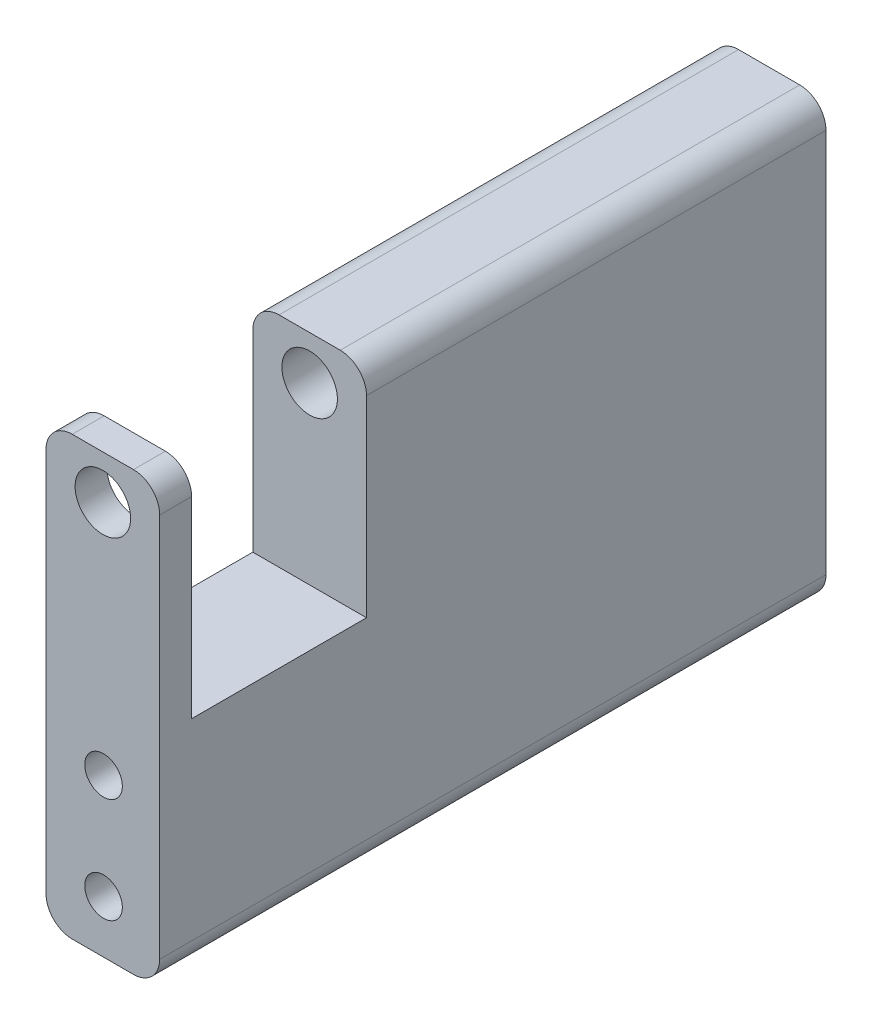
ISO-10303-21;
HEADER;
FILE_DESCRIPTION(('STEP AP214'),'2;1');
FILE_NAME('part.step','',(''),(''),'','','');
FILE_SCHEMA(('AUTOMOTIVE_DESIGN { 1 0 10303 214 1 1 1 1 }'));
ENDSEC;
DATA;
#1=APPLICATION_CONTEXT('core data for automotive mechanical design processes');
#2=APPLICATION_PROTOCOL_DEFINITION('international standard','automotive_design',2000,#1);
#3=PRODUCT_CONTEXT('',#1,'mechanical');
#4=PRODUCT('Part','Part','',(#3));
#5=PRODUCT_RELATED_PRODUCT_CATEGORY('part','',(#4));
#6=PRODUCT_DEFINITION_FORMATION('','',#4);
#7=PRODUCT_DEFINITION_CONTEXT('part definition',#1,'design');
#8=PRODUCT_DEFINITION('design','',#6,#7);
#9=PRODUCT_DEFINITION_SHAPE('','',#8);
#10=(LENGTH_UNIT() NAMED_UNIT(*) SI_UNIT(.MILLI.,.METRE.));
#11=(NAMED_UNIT(*) PLANE_ANGLE_UNIT() SI_UNIT($,.RADIAN.));
#12=(NAMED_UNIT(*) SI_UNIT($,.STERADIAN.) SOLID_ANGLE_UNIT());
#13=UNCERTAINTY_MEASURE_WITH_UNIT(LENGTH_MEASURE(1.E-05),#10,'distance_accuracy_value','');
#14=(GEOMETRIC_REPRESENTATION_CONTEXT(3) GLOBAL_UNCERTAINTY_ASSIGNED_CONTEXT((#13)) GLOBAL_UNIT_ASSIGNED_CONTEXT((#10,
#11,#12)) REPRESENTATION_CONTEXT('',''));
#15=CARTESIAN_POINT('',(0.,0.,0.));
#16=DIRECTION('',(0.,0.,1.));
#17=DIRECTION('',(1.,0.,0.));
#18=AXIS2_PLACEMENT_3D('',#15,#16,#17);
#19=CARTESIAN_POINT('',(0.,50.,76.2));
#20=DIRECTION('',(0.,-1.,0.));
#21=DIRECTION('',(0.,0.,-1.));
#22=AXIS2_PLACEMENT_3D('',#19,#20,#21);
#23=PLANE('',#22);
#24=DIRECTION('',(-1.,0.,0.));
#25=VECTOR('',#24,1.);
#26=CARTESIAN_POINT('',(0.,50.,72.55));
#27=LINE('',#26,#25);
#28=CARTESIAN_POINT('',(10.,50.,72.55));
#29=VERTEX_POINT('',#28);
#30=CARTESIAN_POINT('',(3.,50.,72.55));
#31=VERTEX_POINT('',#30);
#32=EDGE_CURVE('E214',#29,#31,#27,.T.);
#33=ORIENTED_EDGE('',*,*,#32,.T.);
#34=DIRECTION('',(0.,0.,-1.));
#35=VECTOR('',#34,1.);
#36=CARTESIAN_POINT('',(3.,50.,76.2));
#37=LINE('',#36,#35);
#38=CARTESIAN_POINT('',(3.,50.,76.2));
#39=VERTEX_POINT('',#38);
#40=EDGE_CURVE('E338',#31,#39,#37,.F.);
#41=ORIENTED_EDGE('',*,*,#40,.T.);
#42=DIRECTION('',(-1.,0.,0.));
#43=VECTOR('',#42,1.);
#44=CARTESIAN_POINT('',(0.,50.,76.2));
#45=LINE('',#44,#43);
#46=CARTESIAN_POINT('',(10.,50.,76.2));
#47=VERTEX_POINT('',#46);
#48=EDGE_CURVE('E255',#47,#39,#45,.T.);
#49=ORIENTED_EDGE('',*,*,#48,.F.);
#50=DIRECTION('',(0.,0.,-1.));
#51=VECTOR('',#50,1.);
#52=CARTESIAN_POINT('',(10.,50.,76.2));
#53=LINE('',#52,#51);
#54=EDGE_CURVE('E334',#47,#29,#53,.T.);
#55=ORIENTED_EDGE('',*,*,#54,.T.);
#56=EDGE_LOOP('',(#33,#41,#49,#55));
#57=FACE_BOUND('',#56,.T.);
#58=ADVANCED_FACE('F40',(#57),#23,.F.);
#59=CARTESIAN_POINT('',(6.5,45.,76.2));
#60=DIRECTION('',(0.,0.,-1.));
#61=DIRECTION('',(-1.,0.,0.));
#62=AXIS2_PLACEMENT_3D('',#59,#60,#61);
#63=CYLINDRICAL_SURFACE('',#62,3.175);
#64=CARTESIAN_POINT('',(6.5,45.,76.2));
#65=DIRECTION('',(0.,0.,1.));
#66=DIRECTION('',(1.,0.,0.));
#67=AXIS2_PLACEMENT_3D('',#64,#65,#66);
#68=CIRCLE('',#67,3.175);
#69=CARTESIAN_POINT('',(9.675,45.,76.2));
#70=VERTEX_POINT('',#69);
#71=EDGE_CURVE('E232',#70,#70,#68,.T.);
#72=ORIENTED_EDGE('',*,*,#71,.T.);
#73=EDGE_LOOP('',(#72));
#74=FACE_BOUND('',#73,.T.);
#75=CARTESIAN_POINT('',(6.5,45.,72.55));
#76=DIRECTION('',(0.,0.,-1.));
#77=DIRECTION('',(-1.,0.,0.));
#78=AXIS2_PLACEMENT_3D('',#75,#76,#77);
#79=CIRCLE('',#78,3.175);
#80=CARTESIAN_POINT('',(3.32499999999999,45.,72.55));
#81=VERTEX_POINT('',#80);
#82=EDGE_CURVE('E228',#81,#81,#79,.T.);
#83=ORIENTED_EDGE('',*,*,#82,.T.);
#84=EDGE_LOOP('',(#83));
#85=FACE_BOUND('',#84,.T.);
#86=ADVANCED_FACE('F383',(#74,#85),#63,.F.);
#87=CARTESIAN_POINT('',(0.,0.,76.2));
#88=DIRECTION('',(0.,0.,-1.));
#89=DIRECTION('',(-1.,0.,0.));
#90=AXIS2_PLACEMENT_3D('',#87,#88,#89);
#91=PLANE('',#90);
#92=CARTESIAN_POINT('',(6.57924630166814,18.,76.2));
#93=DIRECTION('',(0.,0.,1.));
#94=DIRECTION('',(1.,0.,0.));
#95=AXIS2_PLACEMENT_3D('',#92,#93,#94);
#96=CIRCLE('',#95,2.14999999999999);
#97=CARTESIAN_POINT('',(8.72924630166813,18.,76.2));
#98=VERTEX_POINT('',#97);
#99=EDGE_CURVE('E164',#98,#98,#96,.T.);
#100=ORIENTED_EDGE('',*,*,#99,.F.);
#101=EDGE_LOOP('',(#100));
#102=FACE_BOUND('',#101,.T.);
#103=CARTESIAN_POINT('',(6.57924630166814,6.,76.2));
#104=DIRECTION('',(0.,0.,1.));
#105=DIRECTION('',(1.,0.,0.));
#106=AXIS2_PLACEMENT_3D('',#103,#104,#105);
#107=CIRCLE('',#106,2.14999999999999);
#108=CARTESIAN_POINT('',(8.72924630166813,6.,76.2));
#109=VERTEX_POINT('',#108);
#110=EDGE_CURVE('E163',#109,#109,#107,.T.);
#111=ORIENTED_EDGE('',*,*,#110,.F.);
#112=EDGE_LOOP('',(#111));
#113=FACE_BOUND('',#112,.T.);
#114=DIRECTION('',(0.,-1.,0.));
#115=VECTOR('',#114,1.);
#116=CARTESIAN_POINT('',(0.,0.,76.2));
#117=LINE('',#116,#115);
#118=CARTESIAN_POINT('',(0.,47.,76.2));
#119=VERTEX_POINT('',#118);
#120=CARTESIAN_POINT('',(0.,3.,76.2));
#121=VERTEX_POINT('',#120);
#122=EDGE_CURVE('E242',#119,#121,#117,.T.);
#123=ORIENTED_EDGE('',*,*,#122,.T.);
#124=CARTESIAN_POINT('',(3.,3.,76.2));
#125=DIRECTION('',(0.,0.,-1.));
#126=DIRECTION('',(-1.,0.,0.));
#127=AXIS2_PLACEMENT_3D('',#124,#125,#126);
#128=CIRCLE('',#127,3.);
#129=CARTESIAN_POINT('',(3.,0.,76.2));
#130=VERTEX_POINT('',#129);
#131=EDGE_CURVE('E315',#121,#130,#128,.F.);
#132=ORIENTED_EDGE('',*,*,#131,.T.);
#133=DIRECTION('',(1.,0.,0.));
#134=VECTOR('',#133,1.);
#135=CARTESIAN_POINT('',(0.,0.,76.2));
#136=LINE('',#135,#134);
#137=CARTESIAN_POINT('',(10.,0.,76.2));
#138=VERTEX_POINT('',#137);
#139=EDGE_CURVE('E246',#130,#138,#136,.T.);
#140=ORIENTED_EDGE('',*,*,#139,.T.);
#141=CARTESIAN_POINT('',(10.,3.,76.2));
#142=DIRECTION('',(0.,0.,-1.));
#143=DIRECTION('',(-1.,0.,0.));
#144=AXIS2_PLACEMENT_3D('',#141,#142,#143);
#145=CIRCLE('',#144,3.);
#146=CARTESIAN_POINT('',(13.,3.,76.2));
#147=VERTEX_POINT('',#146);
#148=EDGE_CURVE('E312',#138,#147,#145,.F.);
#149=ORIENTED_EDGE('',*,*,#148,.T.);
#150=DIRECTION('',(0.,1.,0.));
#151=VECTOR('',#150,1.);
#152=CARTESIAN_POINT('',(13.,0.,76.2));
#153=LINE('',#152,#151);
#154=CARTESIAN_POINT('',(13.,47.,76.2));
#155=VERTEX_POINT('',#154);
#156=EDGE_CURVE('E251',#147,#155,#153,.T.);
#157=ORIENTED_EDGE('',*,*,#156,.T.);
#158=CARTESIAN_POINT('',(10.,47.,76.2));
#159=DIRECTION('',(0.,0.,-1.));
#160=DIRECTION('',(-1.,0.,0.));
#161=AXIS2_PLACEMENT_3D('',#158,#159,#160);
#162=CIRCLE('',#161,3.);
#163=EDGE_CURVE('E306',#155,#47,#162,.F.);
#164=ORIENTED_EDGE('',*,*,#163,.T.);
#165=ORIENTED_EDGE('',*,*,#48,.T.);
#166=CARTESIAN_POINT('',(3.,47.,76.2));
#167=DIRECTION('',(0.,0.,-1.));
#168=DIRECTION('',(-1.,0.,0.));
#169=AXIS2_PLACEMENT_3D('',#166,#167,#168);
#170=CIRCLE('',#169,3.);
#171=EDGE_CURVE('E309',#39,#119,#170,.F.);
#172=ORIENTED_EDGE('',*,*,#171,.T.);
#173=EDGE_LOOP('',(#123,#132,#140,#149,#157,#164,#165,#172));
#174=FACE_BOUND('',#173,.T.);
#175=ORIENTED_EDGE('',*,*,#71,.F.);
#176=EDGE_LOOP('',(#175));
#177=FACE_BOUND('',#176,.T.);
#178=ADVANCED_FACE('F389',(#102,#113,#174,#177),#91,.F.);
#179=CARTESIAN_POINT('',(0.,0.,0.));
#180=DIRECTION('',(0.,0.,-1.));
#181=DIRECTION('',(-1.,0.,0.));
#182=AXIS2_PLACEMENT_3D('',#179,#180,#181);
#183=PLANE('',#182);
#184=CARTESIAN_POINT('',(6.57924630166814,18.,0.));
#185=DIRECTION('',(0.,0.,-1.));
#186=DIRECTION('',(-1.,0.,0.));
#187=AXIS2_PLACEMENT_3D('',#184,#185,#186);
#188=CIRCLE('',#187,2.14999999999999);
#189=CARTESIAN_POINT('',(4.42924630166815,18.,0.));
#190=VERTEX_POINT('',#189);
#191=EDGE_CURVE('E179',#190,#190,#188,.T.);
#192=ORIENTED_EDGE('',*,*,#191,.F.);
#193=EDGE_LOOP('',(#192));
#194=FACE_BOUND('',#193,.T.);
#195=CARTESIAN_POINT('',(6.57924630166814,6.,0.));
#196=DIRECTION('',(0.,0.,-1.));
#197=DIRECTION('',(-1.,0.,0.));
#198=AXIS2_PLACEMENT_3D('',#195,#196,#197);
#199=CIRCLE('',#198,2.14999999999999);
#200=CARTESIAN_POINT('',(4.42924630166815,6.,0.));
#201=VERTEX_POINT('',#200);
#202=EDGE_CURVE('E187',#201,#201,#199,.T.);
#203=ORIENTED_EDGE('',*,*,#202,.F.);
#204=EDGE_LOOP('',(#203));
#205=FACE_BOUND('',#204,.T.);
#206=DIRECTION('',(1.,0.,0.));
#207=VECTOR('',#206,1.);
#208=CARTESIAN_POINT('',(0.,0.,0.));
#209=LINE('',#208,#207);
#210=CARTESIAN_POINT('',(3.,0.,0.));
#211=VERTEX_POINT('',#210);
#212=CARTESIAN_POINT('',(10.,0.,0.));
#213=VERTEX_POINT('',#212);
#214=EDGE_CURVE('E263',#211,#213,#209,.T.);
#215=ORIENTED_EDGE('',*,*,#214,.F.);
#216=CARTESIAN_POINT('',(3.,3.,0.));
#217=DIRECTION('',(0.,0.,-1.));
#218=DIRECTION('',(-1.,0.,0.));
#219=AXIS2_PLACEMENT_3D('',#216,#217,#218);
#220=CIRCLE('',#219,3.);
#221=CARTESIAN_POINT('',(0.,3.,0.));
#222=VERTEX_POINT('',#221);
#223=EDGE_CURVE('E292',#211,#222,#220,.T.);
#224=ORIENTED_EDGE('',*,*,#223,.T.);
#225=DIRECTION('',(0.,-1.,0.));
#226=VECTOR('',#225,1.);
#227=CARTESIAN_POINT('',(0.,0.,0.));
#228=LINE('',#227,#226);
#229=CARTESIAN_POINT('',(0.,47.,0.));
#230=VERTEX_POINT('',#229);
#231=EDGE_CURVE('E236',#230,#222,#228,.T.);
#232=ORIENTED_EDGE('',*,*,#231,.F.);
#233=CARTESIAN_POINT('',(3.,47.,0.));
#234=DIRECTION('',(0.,0.,-1.));
#235=DIRECTION('',(-1.,0.,0.));
#236=AXIS2_PLACEMENT_3D('',#233,#234,#235);
#237=CIRCLE('',#236,3.);
#238=CARTESIAN_POINT('',(3.,50.,0.));
#239=VERTEX_POINT('',#238);
#240=EDGE_CURVE('E286',#230,#239,#237,.T.);
#241=ORIENTED_EDGE('',*,*,#240,.T.);
#242=DIRECTION('',(-1.,0.,0.));
#243=VECTOR('',#242,1.);
#244=CARTESIAN_POINT('',(0.,50.,0.));
#245=LINE('',#244,#243);
#246=CARTESIAN_POINT('',(10.,50.,0.));
#247=VERTEX_POINT('',#246);
#248=EDGE_CURVE('E247',#247,#239,#245,.T.);
#249=ORIENTED_EDGE('',*,*,#248,.F.);
#250=CARTESIAN_POINT('',(10.,47.,0.));
#251=DIRECTION('',(0.,0.,-1.));
#252=DIRECTION('',(-1.,0.,0.));
#253=AXIS2_PLACEMENT_3D('',#250,#251,#252);
#254=CIRCLE('',#253,3.);
#255=CARTESIAN_POINT('',(13.,47.,0.));
#256=VERTEX_POINT('',#255);
#257=EDGE_CURVE('E283',#247,#256,#254,.T.);
#258=ORIENTED_EDGE('',*,*,#257,.T.);
#259=DIRECTION('',(0.,1.,0.));
#260=VECTOR('',#259,1.);
#261=CARTESIAN_POINT('',(13.,0.,0.));
#262=LINE('',#261,#260);
#263=CARTESIAN_POINT('',(13.,3.,0.));
#264=VERTEX_POINT('',#263);
#265=EDGE_CURVE('E267',#264,#256,#262,.T.);
#266=ORIENTED_EDGE('',*,*,#265,.F.);
#267=CARTESIAN_POINT('',(10.,3.,0.));
#268=DIRECTION('',(0.,0.,-1.));
#269=DIRECTION('',(-1.,0.,0.));
#270=AXIS2_PLACEMENT_3D('',#267,#268,#269);
#271=CIRCLE('',#270,3.);
#272=EDGE_CURVE('E289',#264,#213,#271,.T.);
#273=ORIENTED_EDGE('',*,*,#272,.T.);
#274=EDGE_LOOP('',(#215,#224,#232,#241,#249,#258,#266,#273));
#275=FACE_BOUND('',#274,.T.);
#276=CARTESIAN_POINT('',(6.5,45.,0.));
#277=DIRECTION('',(0.,0.,1.));
#278=DIRECTION('',(1.,0.,0.));
#279=AXIS2_PLACEMENT_3D('',#276,#277,#278);
#280=CIRCLE('',#279,3.175);
#281=CARTESIAN_POINT('',(9.675,45.,0.));
#282=VERTEX_POINT('',#281);
#283=EDGE_CURVE('E237',#282,#282,#280,.T.);
#284=ORIENTED_EDGE('',*,*,#283,.T.);
#285=EDGE_LOOP('',(#284));
#286=FACE_BOUND('',#285,.T.);
#287=ADVANCED_FACE('F353',(#194,#205,#275,#286),#183,.T.);
#288=CARTESIAN_POINT('',(0.,0.,76.2));
#289=DIRECTION('',(1.,0.,0.));
#290=DIRECTION('',(0.,0.,-1.));
#291=AXIS2_PLACEMENT_3D('',#288,#289,#290);
#292=PLANE('',#291);
#293=ORIENTED_EDGE('',*,*,#231,.T.);
#294=DIRECTION('',(0.,0.,-1.));
#295=VECTOR('',#294,1.);
#296=CARTESIAN_POINT('',(0.,3.,76.2));
#297=LINE('',#296,#295);
#298=EDGE_CURVE('E303',#222,#121,#297,.F.);
#299=ORIENTED_EDGE('',*,*,#298,.T.);
#300=ORIENTED_EDGE('',*,*,#122,.F.);
#301=DIRECTION('',(0.,0.,-1.));
#302=VECTOR('',#301,1.);
#303=CARTESIAN_POINT('',(0.,47.,76.2));
#304=LINE('',#303,#302);
#305=CARTESIAN_POINT('',(0.,47.,72.55));
#306=VERTEX_POINT('',#305);
#307=EDGE_CURVE('E299',#119,#306,#304,.T.);
#308=ORIENTED_EDGE('',*,*,#307,.T.);
#309=DIRECTION('',(0.,-1.,0.));
#310=VECTOR('',#309,1.);
#311=CARTESIAN_POINT('',(0.,50.,72.55));
#312=LINE('',#311,#310);
#313=CARTESIAN_POINT('',(0.,25.,72.55));
#314=VERTEX_POINT('',#313);
#315=EDGE_CURVE('E218',#306,#314,#312,.T.);
#316=ORIENTED_EDGE('',*,*,#315,.T.);
#317=DIRECTION('',(0.,0.,1.));
#318=VECTOR('',#317,1.);
#319=CARTESIAN_POINT('',(0.,25.,52.55));
#320=LINE('',#319,#318);
#321=CARTESIAN_POINT('',(0.,25.,52.55));
#322=VERTEX_POINT('',#321);
#323=EDGE_CURVE('E210',#322,#314,#320,.T.);
#324=ORIENTED_EDGE('',*,*,#323,.F.);
#325=DIRECTION('',(0.,-1.,0.));
#326=VECTOR('',#325,1.);
#327=CARTESIAN_POINT('',(0.,50.,52.55));
#328=LINE('',#327,#326);
#329=CARTESIAN_POINT('',(0.,47.,52.55));
#330=VERTEX_POINT('',#329);
#331=EDGE_CURVE('E203',#330,#322,#328,.T.);
#332=ORIENTED_EDGE('',*,*,#331,.F.);
#333=DIRECTION('',(0.,0.,-1.));
#334=VECTOR('',#333,1.);
#335=CARTESIAN_POINT('',(0.,47.,76.2));
#336=LINE('',#335,#334);
#337=EDGE_CURVE('E295',#330,#230,#336,.T.);
#338=ORIENTED_EDGE('',*,*,#337,.T.);
#339=EDGE_LOOP('',(#293,#299,#300,#308,#316,#324,#332,#338));
#340=FACE_BOUND('',#339,.T.);
#341=ADVANCED_FACE('F363',(#340),#292,.F.);
#342=CARTESIAN_POINT('',(0.,0.,76.2));
#343=DIRECTION('',(0.,1.,0.));
#344=DIRECTION('',(0.,0.,1.));
#345=AXIS2_PLACEMENT_3D('',#342,#343,#344);
#346=PLANE('',#345);
#347=ORIENTED_EDGE('',*,*,#139,.F.);
#348=DIRECTION('',(0.,0.,-1.));
#349=VECTOR('',#348,1.);
#350=CARTESIAN_POINT('',(3.,0.,76.2));
#351=LINE('',#350,#349);
#352=EDGE_CURVE('E280',#130,#211,#351,.T.);
#353=ORIENTED_EDGE('',*,*,#352,.T.);
#354=ORIENTED_EDGE('',*,*,#214,.T.);
#355=DIRECTION('',(0.,0.,-1.));
#356=VECTOR('',#355,1.);
#357=CARTESIAN_POINT('',(10.,0.,76.2));
#358=LINE('',#357,#356);
#359=EDGE_CURVE('E259',#213,#138,#358,.F.);
#360=ORIENTED_EDGE('',*,*,#359,.T.);
#361=EDGE_LOOP('',(#347,#353,#354,#360));
#362=FACE_BOUND('',#361,.T.);
#363=ADVANCED_FACE('F401',(#362),#346,.F.);
#364=CARTESIAN_POINT('',(13.,0.,76.2));
#365=DIRECTION('',(-1.,0.,0.));
#366=DIRECTION('',(0.,0.,1.));
#367=AXIS2_PLACEMENT_3D('',#364,#365,#366);
#368=PLANE('',#367);
#369=ORIENTED_EDGE('',*,*,#156,.F.);
#370=DIRECTION('',(0.,0.,-1.));
#371=VECTOR('',#370,1.);
#372=CARTESIAN_POINT('',(13.,3.,76.2));
#373=LINE('',#372,#371);
#374=EDGE_CURVE('E324',#147,#264,#373,.T.);
#375=ORIENTED_EDGE('',*,*,#374,.T.);
#376=ORIENTED_EDGE('',*,*,#265,.T.);
#377=DIRECTION('',(0.,0.,-1.));
#378=VECTOR('',#377,1.);
#379=CARTESIAN_POINT('',(13.,47.,76.2));
#380=LINE('',#379,#378);
#381=CARTESIAN_POINT('',(13.,47.,52.55));
#382=VERTEX_POINT('',#381);
#383=EDGE_CURVE('E318',#256,#382,#380,.F.);
#384=ORIENTED_EDGE('',*,*,#383,.T.);
#385=DIRECTION('',(0.,1.,0.));
#386=VECTOR('',#385,1.);
#387=CARTESIAN_POINT('',(13.,25.,52.55));
#388=LINE('',#387,#386);
#389=CARTESIAN_POINT('',(13.,25.,52.55));
#390=VERTEX_POINT('',#389);
#391=EDGE_CURVE('E196',#390,#382,#388,.T.);
#392=ORIENTED_EDGE('',*,*,#391,.F.);
#393=DIRECTION('',(0.,0.,1.));
#394=VECTOR('',#393,1.);
#395=CARTESIAN_POINT('',(13.,25.,52.55));
#396=LINE('',#395,#394);
#397=CARTESIAN_POINT('',(13.,25.,72.55));
#398=VERTEX_POINT('',#397);
#399=EDGE_CURVE('E224',#390,#398,#396,.T.);
#400=ORIENTED_EDGE('',*,*,#399,.T.);
#401=DIRECTION('',(0.,1.,0.));
#402=VECTOR('',#401,1.);
#403=CARTESIAN_POINT('',(13.,25.,72.55));
#404=LINE('',#403,#402);
#405=CARTESIAN_POINT('',(13.,47.,72.55));
#406=VERTEX_POINT('',#405);
#407=EDGE_CURVE('E195',#398,#406,#404,.T.);
#408=ORIENTED_EDGE('',*,*,#407,.T.);
#409=DIRECTION('',(0.,0.,-1.));
#410=VECTOR('',#409,1.);
#411=CARTESIAN_POINT('',(13.,47.,76.2));
#412=LINE('',#411,#410);
#413=EDGE_CURVE('E321',#406,#155,#412,.F.);
#414=ORIENTED_EDGE('',*,*,#413,.T.);
#415=EDGE_LOOP('',(#369,#375,#376,#384,#392,#400,#408,#414));
#416=FACE_BOUND('',#415,.T.);
#417=ADVANCED_FACE('F374',(#416),#368,.F.);
#418=ORIENTED_EDGE('',*,*,#248,.T.);
#419=DIRECTION('',(0.,0.,-1.));
#420=VECTOR('',#419,1.);
#421=CARTESIAN_POINT('',(3.,50.,76.2));
#422=LINE('',#421,#420);
#423=CARTESIAN_POINT('',(3.,50.,52.55));
#424=VERTEX_POINT('',#423);
#425=EDGE_CURVE('E56',#239,#424,#422,.F.);
#426=ORIENTED_EDGE('',*,*,#425,.T.);
#427=DIRECTION('',(-1.,0.,0.));
#428=VECTOR('',#427,1.);
#429=CARTESIAN_POINT('',(0.,50.,52.55));
#430=LINE('',#429,#428);
#431=CARTESIAN_POINT('',(10.,50.,52.55));
#432=VERTEX_POINT('',#431);
#433=EDGE_CURVE('E199',#432,#424,#430,.T.);
#434=ORIENTED_EDGE('',*,*,#433,.F.);
#435=DIRECTION('',(0.,0.,-1.));
#436=VECTOR('',#435,1.);
#437=CARTESIAN_POINT('',(10.,50.,76.2));
#438=LINE('',#437,#436);
#439=EDGE_CURVE('E341',#432,#247,#438,.T.);
#440=ORIENTED_EDGE('',*,*,#439,.T.);
#441=EDGE_LOOP('',(#418,#426,#434,#440));
#442=FACE_BOUND('',#441,.T.);
#443=ADVANCED_FACE('F349',(#442),#23,.F.);
#444=CARTESIAN_POINT('',(6.5,45.,52.55));
#445=DIRECTION('',(0.,0.,-1.));
#446=DIRECTION('',(-1.,0.,0.));
#447=AXIS2_PLACEMENT_3D('',#444,#445,#446);
#448=CIRCLE('',#447,3.175);
#449=CARTESIAN_POINT('',(3.32499999999999,45.,52.55));
#450=VERTEX_POINT('',#449);
#451=EDGE_CURVE('E241',#450,#450,#448,.T.);
#452=ORIENTED_EDGE('',*,*,#451,.F.);
#453=EDGE_LOOP('',(#452));
#454=FACE_BOUND('',#453,.T.);
#455=ORIENTED_EDGE('',*,*,#283,.F.);
#456=EDGE_LOOP('',(#455));
#457=FACE_BOUND('',#456,.T.);
#458=ADVANCED_FACE('F392',(#454,#457),#63,.F.);
#459=CARTESIAN_POINT('',(0.,25.,52.55));
#460=DIRECTION('',(0.,-1.,0.));
#461=DIRECTION('',(0.,0.,-1.));
#462=AXIS2_PLACEMENT_3D('',#459,#460,#461);
#463=PLANE('',#462);
#464=DIRECTION('',(1.,0.,0.));
#465=VECTOR('',#464,1.);
#466=CARTESIAN_POINT('',(0.,25.,72.55));
#467=LINE('',#466,#465);
#468=EDGE_CURVE('E200',#314,#398,#467,.T.);
#469=ORIENTED_EDGE('',*,*,#468,.T.);
#470=ORIENTED_EDGE('',*,*,#399,.F.);
#471=DIRECTION('',(1.,0.,0.));
#472=VECTOR('',#471,1.);
#473=CARTESIAN_POINT('',(0.,25.,52.55));
#474=LINE('',#473,#472);
#475=EDGE_CURVE('E206',#322,#390,#474,.T.);
#476=ORIENTED_EDGE('',*,*,#475,.F.);
#477=ORIENTED_EDGE('',*,*,#323,.T.);
#478=EDGE_LOOP('',(#469,#470,#476,#477));
#479=FACE_BOUND('',#478,.T.);
#480=ADVANCED_FACE('F370',(#479),#463,.F.);
#481=CARTESIAN_POINT('',(0.,0.,52.55));
#482=DIRECTION('',(0.,0.,-1.));
#483=DIRECTION('',(-1.,0.,0.));
#484=AXIS2_PLACEMENT_3D('',#481,#482,#483);
#485=PLANE('',#484);
#486=ORIENTED_EDGE('',*,*,#451,.T.);
#487=EDGE_LOOP('',(#486));
#488=FACE_BOUND('',#487,.T.);
#489=ORIENTED_EDGE('',*,*,#433,.T.);
#490=CARTESIAN_POINT('',(3.,47.,52.55));
#491=DIRECTION('',(0.,0.,-1.));
#492=DIRECTION('',(-1.,0.,0.));
#493=AXIS2_PLACEMENT_3D('',#490,#491,#492);
#494=CIRCLE('',#493,3.);
#495=EDGE_CURVE('E11',#424,#330,#494,.F.);
#496=ORIENTED_EDGE('',*,*,#495,.T.);
#497=ORIENTED_EDGE('',*,*,#331,.T.);
#498=ORIENTED_EDGE('',*,*,#475,.T.);
#499=ORIENTED_EDGE('',*,*,#391,.T.);
#500=CARTESIAN_POINT('',(10.,47.,52.55));
#501=DIRECTION('',(0.,0.,-1.));
#502=DIRECTION('',(-1.,0.,0.));
#503=AXIS2_PLACEMENT_3D('',#500,#501,#502);
#504=CIRCLE('',#503,3.);
#505=EDGE_CURVE('E49',#382,#432,#504,.F.);
#506=ORIENTED_EDGE('',*,*,#505,.T.);
#507=EDGE_LOOP('',(#489,#496,#497,#498,#499,#506));
#508=FACE_BOUND('',#507,.T.);
#509=ADVANCED_FACE('F367',(#488,#508),#485,.F.);
#510=CARTESIAN_POINT('',(0.,0.,72.55));
#511=DIRECTION('',(0.,0.,-1.));
#512=DIRECTION('',(-1.,0.,0.));
#513=AXIS2_PLACEMENT_3D('',#510,#511,#512);
#514=PLANE('',#513);
#515=ORIENTED_EDGE('',*,*,#82,.F.);
#516=EDGE_LOOP('',(#515));
#517=FACE_BOUND('',#516,.T.);
#518=ORIENTED_EDGE('',*,*,#315,.F.);
#519=CARTESIAN_POINT('',(3.,47.,72.55));
#520=DIRECTION('',(0.,0.,-1.));
#521=DIRECTION('',(-1.,0.,0.));
#522=AXIS2_PLACEMENT_3D('',#519,#520,#521);
#523=CIRCLE('',#522,3.);
#524=EDGE_CURVE('E331',#306,#31,#523,.T.);
#525=ORIENTED_EDGE('',*,*,#524,.T.);
#526=ORIENTED_EDGE('',*,*,#32,.F.);
#527=CARTESIAN_POINT('',(10.,47.,72.55));
#528=DIRECTION('',(0.,0.,-1.));
#529=DIRECTION('',(-1.,0.,0.));
#530=AXIS2_PLACEMENT_3D('',#527,#528,#529);
#531=CIRCLE('',#530,3.);
#532=EDGE_CURVE('E328',#29,#406,#531,.T.);
#533=ORIENTED_EDGE('',*,*,#532,.T.);
#534=ORIENTED_EDGE('',*,*,#407,.F.);
#535=ORIENTED_EDGE('',*,*,#468,.F.);
#536=EDGE_LOOP('',(#518,#525,#526,#533,#534,#535));
#537=FACE_BOUND('',#536,.T.);
#538=ADVANCED_FACE('F444',(#517,#537),#514,.T.);
#539=CARTESIAN_POINT('',(6.57924630166814,6.,5.));
#540=DIRECTION('',(0.,0.,-1.));
#541=DIRECTION('',(-1.,0.,0.));
#542=AXIS2_PLACEMENT_3D('',#539,#540,#541);
#543=CONICAL_SURFACE('',#542,2.14999999999999,1.02974425867665);
#544=CARTESIAN_POINT('',(6.57924630166814,6.,6.29185033090925));
#545=VERTEX_POINT('',#544);
#546=VERTEX_LOOP('',#545);
#547=FACE_BOUND('',#546,.T.);
#548=CARTESIAN_POINT('',(6.57924630166814,6.,5.));
#549=DIRECTION('',(0.,0.,-1.));
#550=DIRECTION('',(-1.,0.,0.));
#551=AXIS2_PLACEMENT_3D('',#548,#549,#550);
#552=CIRCLE('',#551,2.14999999999999);
#553=CARTESIAN_POINT('',(4.42924630166815,6.,5.));
#554=VERTEX_POINT('',#553);
#555=EDGE_CURVE('E191',#554,#554,#552,.T.);
#556=ORIENTED_EDGE('',*,*,#555,.T.);
#557=EDGE_LOOP('',(#556));
#558=FACE_BOUND('',#557,.T.);
#559=ADVANCED_FACE('F446',(#547,#558),#543,.F.);
#560=CARTESIAN_POINT('',(6.57924630166814,6.,0.));
#561=DIRECTION('',(0.,0.,-1.));
#562=DIRECTION('',(-1.,0.,0.));
#563=AXIS2_PLACEMENT_3D('',#560,#561,#562);
#564=CYLINDRICAL_SURFACE('',#563,2.14999999999999);
#565=ORIENTED_EDGE('',*,*,#555,.F.);
#566=EDGE_LOOP('',(#565));
#567=FACE_BOUND('',#566,.T.);
#568=ORIENTED_EDGE('',*,*,#202,.T.);
#569=EDGE_LOOP('',(#568));
#570=FACE_BOUND('',#569,.T.);
#571=ADVANCED_FACE('F453',(#567,#570),#564,.F.);
#572=CARTESIAN_POINT('',(6.57924630166814,18.,5.));
#573=DIRECTION('',(0.,0.,-1.));
#574=DIRECTION('',(-1.,0.,0.));
#575=AXIS2_PLACEMENT_3D('',#572,#573,#574);
#576=CONICAL_SURFACE('',#575,2.14999999999999,1.02974425867665);
#577=CARTESIAN_POINT('',(6.57924630166814,18.,6.29185033090925));
#578=VERTEX_POINT('',#577);
#579=VERTEX_LOOP('',#578);
#580=FACE_BOUND('',#579,.T.);
#581=CARTESIAN_POINT('',(6.57924630166814,18.,5.));
#582=DIRECTION('',(0.,0.,-1.));
#583=DIRECTION('',(-1.,0.,0.));
#584=AXIS2_PLACEMENT_3D('',#581,#582,#583);
#585=CIRCLE('',#584,2.14999999999999);
#586=CARTESIAN_POINT('',(4.42924630166815,18.,5.));
#587=VERTEX_POINT('',#586);
#588=EDGE_CURVE('E183',#587,#587,#585,.T.);
#589=ORIENTED_EDGE('',*,*,#588,.T.);
#590=EDGE_LOOP('',(#589));
#591=FACE_BOUND('',#590,.T.);
#592=ADVANCED_FACE('F473',(#580,#591),#576,.F.);
#593=CARTESIAN_POINT('',(6.57924630166814,18.,0.));
#594=DIRECTION('',(0.,0.,-1.));
#595=DIRECTION('',(-1.,0.,0.));
#596=AXIS2_PLACEMENT_3D('',#593,#594,#595);
#597=CYLINDRICAL_SURFACE('',#596,2.14999999999999);
#598=ORIENTED_EDGE('',*,*,#588,.F.);
#599=EDGE_LOOP('',(#598));
#600=FACE_BOUND('',#599,.T.);
#601=ORIENTED_EDGE('',*,*,#191,.T.);
#602=EDGE_LOOP('',(#601));
#603=FACE_BOUND('',#602,.T.);
#604=ADVANCED_FACE('F479',(#600,#603),#597,.F.);
#605=CARTESIAN_POINT('',(6.57924630166814,6.,71.2));
#606=DIRECTION('',(0.,0.,1.));
#607=DIRECTION('',(1.,0.,0.));
#608=AXIS2_PLACEMENT_3D('',#605,#606,#607);
#609=CONICAL_SURFACE('',#608,2.14999999999999,1.02974425867665);
#610=CARTESIAN_POINT('',(6.57924630166814,6.,69.9081496690907));
#611=VERTEX_POINT('',#610);
#612=VERTEX_LOOP('',#611);
#613=FACE_BOUND('',#612,.T.);
#614=CARTESIAN_POINT('',(6.57924630166814,6.,71.2));
#615=DIRECTION('',(0.,0.,1.));
#616=DIRECTION('',(1.,0.,0.));
#617=AXIS2_PLACEMENT_3D('',#614,#615,#616);
#618=CIRCLE('',#617,2.14999999999999);
#619=CARTESIAN_POINT('',(8.72924630166813,6.,71.2));
#620=VERTEX_POINT('',#619);
#621=EDGE_CURVE('E170',#620,#620,#618,.T.);
#622=ORIENTED_EDGE('',*,*,#621,.T.);
#623=EDGE_LOOP('',(#622));
#624=FACE_BOUND('',#623,.T.);
#625=ADVANCED_FACE('F486',(#613,#624),#609,.F.);
#626=CARTESIAN_POINT('',(6.57924630166814,6.,76.2));
#627=DIRECTION('',(0.,0.,1.));
#628=DIRECTION('',(1.,0.,0.));
#629=AXIS2_PLACEMENT_3D('',#626,#627,#628);
#630=CYLINDRICAL_SURFACE('',#629,2.14999999999999);
#631=ORIENTED_EDGE('',*,*,#621,.F.);
#632=EDGE_LOOP('',(#631));
#633=FACE_BOUND('',#632,.T.);
#634=ORIENTED_EDGE('',*,*,#110,.T.);
#635=EDGE_LOOP('',(#634));
#636=FACE_BOUND('',#635,.T.);
#637=ADVANCED_FACE('F156',(#633,#636),#630,.F.);
#638=CARTESIAN_POINT('',(6.57924630166814,18.,71.2));
#639=DIRECTION('',(0.,0.,1.));
#640=DIRECTION('',(1.,0.,0.));
#641=AXIS2_PLACEMENT_3D('',#638,#639,#640);
#642=CONICAL_SURFACE('',#641,2.14999999999999,1.02974425867665);
#643=CARTESIAN_POINT('',(6.57924630166814,18.,69.9081496690907));
#644=VERTEX_POINT('',#643);
#645=VERTEX_LOOP('',#644);
#646=FACE_BOUND('',#645,.T.);
#647=CARTESIAN_POINT('',(6.57924630166814,18.,71.2));
#648=DIRECTION('',(0.,0.,1.));
#649=DIRECTION('',(1.,0.,0.));
#650=AXIS2_PLACEMENT_3D('',#647,#648,#649);
#651=CIRCLE('',#650,2.14999999999999);
#652=CARTESIAN_POINT('',(8.72924630166813,18.,71.2));
#653=VERTEX_POINT('',#652);
#654=EDGE_CURVE('E160',#653,#653,#651,.T.);
#655=ORIENTED_EDGE('',*,*,#654,.T.);
#656=EDGE_LOOP('',(#655));
#657=FACE_BOUND('',#656,.T.);
#658=ADVANCED_FACE('F152',(#646,#657),#642,.F.);
#659=CARTESIAN_POINT('',(6.57924630166814,18.,76.2));
#660=DIRECTION('',(0.,0.,1.));
#661=DIRECTION('',(1.,0.,0.));
#662=AXIS2_PLACEMENT_3D('',#659,#660,#661);
#663=CYLINDRICAL_SURFACE('',#662,2.14999999999999);
#664=ORIENTED_EDGE('',*,*,#654,.F.);
#665=EDGE_LOOP('',(#664));
#666=FACE_BOUND('',#665,.T.);
#667=ORIENTED_EDGE('',*,*,#99,.T.);
#668=EDGE_LOOP('',(#667));
#669=FACE_BOUND('',#668,.T.);
#670=ADVANCED_FACE('F155',(#666,#669),#663,.F.);
#671=CARTESIAN_POINT('',(3.,3.,76.2));
#672=DIRECTION('',(0.,0.,-1.));
#673=DIRECTION('',(-1.,0.,0.));
#674=AXIS2_PLACEMENT_3D('',#671,#672,#673);
#675=CYLINDRICAL_SURFACE('',#674,3.);
#676=ORIENTED_EDGE('',*,*,#131,.F.);
#677=ORIENTED_EDGE('',*,*,#298,.F.);
#678=ORIENTED_EDGE('',*,*,#223,.F.);
#679=ORIENTED_EDGE('',*,*,#352,.F.);
#680=EDGE_LOOP('',(#676,#677,#678,#679));
#681=FACE_BOUND('',#680,.T.);
#682=ADVANCED_FACE('F410',(#681),#675,.T.);
#683=CARTESIAN_POINT('',(10.,3.,76.2));
#684=DIRECTION('',(0.,0.,-1.));
#685=DIRECTION('',(-1.,0.,0.));
#686=AXIS2_PLACEMENT_3D('',#683,#684,#685);
#687=CYLINDRICAL_SURFACE('',#686,3.);
#688=ORIENTED_EDGE('',*,*,#148,.F.);
#689=ORIENTED_EDGE('',*,*,#359,.F.);
#690=ORIENTED_EDGE('',*,*,#272,.F.);
#691=ORIENTED_EDGE('',*,*,#374,.F.);
#692=EDGE_LOOP('',(#688,#689,#690,#691));
#693=FACE_BOUND('',#692,.T.);
#694=ADVANCED_FACE('F413',(#693),#687,.T.);
#695=CARTESIAN_POINT('',(3.,47.,76.2));
#696=DIRECTION('',(0.,0.,-1.));
#697=DIRECTION('',(-1.,0.,0.));
#698=AXIS2_PLACEMENT_3D('',#695,#696,#697);
#699=CYLINDRICAL_SURFACE('',#698,3.);
#700=ORIENTED_EDGE('',*,*,#171,.F.);
#701=ORIENTED_EDGE('',*,*,#40,.F.);
#702=ORIENTED_EDGE('',*,*,#524,.F.);
#703=ORIENTED_EDGE('',*,*,#307,.F.);
#704=EDGE_LOOP('',(#700,#701,#702,#703));
#705=FACE_BOUND('',#704,.T.);
#706=ADVANCED_FACE('F417',(#705),#699,.T.);
#707=CARTESIAN_POINT('',(10.,47.,76.2));
#708=DIRECTION('',(0.,0.,-1.));
#709=DIRECTION('',(-1.,0.,0.));
#710=AXIS2_PLACEMENT_3D('',#707,#708,#709);
#711=CYLINDRICAL_SURFACE('',#710,3.);
#712=ORIENTED_EDGE('',*,*,#163,.F.);
#713=ORIENTED_EDGE('',*,*,#413,.F.);
#714=ORIENTED_EDGE('',*,*,#532,.F.);
#715=ORIENTED_EDGE('',*,*,#54,.F.);
#716=EDGE_LOOP('',(#712,#713,#714,#715));
#717=FACE_BOUND('',#716,.T.);
#718=ADVANCED_FACE('F381',(#717),#711,.T.);
#719=CARTESIAN_POINT('',(3.,47.,76.2));
#720=DIRECTION('',(0.,0.,-1.));
#721=DIRECTION('',(-1.,0.,0.));
#722=AXIS2_PLACEMENT_3D('',#719,#720,#721);
#723=CYLINDRICAL_SURFACE('',#722,3.);
#724=ORIENTED_EDGE('',*,*,#495,.F.);
#725=ORIENTED_EDGE('',*,*,#425,.F.);
#726=ORIENTED_EDGE('',*,*,#240,.F.);
#727=ORIENTED_EDGE('',*,*,#337,.F.);
#728=EDGE_LOOP('',(#724,#725,#726,#727));
#729=FACE_BOUND('',#728,.T.);
#730=ADVANCED_FACE('F360',(#729),#723,.T.);
#731=CARTESIAN_POINT('',(10.,47.,76.2));
#732=DIRECTION('',(0.,0.,-1.));
#733=DIRECTION('',(-1.,0.,0.));
#734=AXIS2_PLACEMENT_3D('',#731,#732,#733);
#735=CYLINDRICAL_SURFACE('',#734,3.);
#736=ORIENTED_EDGE('',*,*,#505,.F.);
#737=ORIENTED_EDGE('',*,*,#383,.F.);
#738=ORIENTED_EDGE('',*,*,#257,.F.);
#739=ORIENTED_EDGE('',*,*,#439,.F.);
#740=EDGE_LOOP('',(#736,#737,#738,#739));
#741=FACE_BOUND('',#740,.T.);
#742=ADVANCED_FACE('F42',(#741),#735,.T.);
#743=CLOSED_SHELL('',(#58,#86,#178,#287,#341,#363,#417,#443,#458,#480,#509,#538,#559,#571,#592,
#604,#625,#637,#658,#670,#682,#694,#706,#718,#730,#742));
#744=MANIFOLD_SOLID_BREP('B2',#743);
#745=ADVANCED_BREP_SHAPE_REPRESENTATION('',(#18,#744),#14);
#746=SHAPE_DEFINITION_REPRESENTATION(#9,#745);
ENDSEC;
END-ISO-10303-21;
